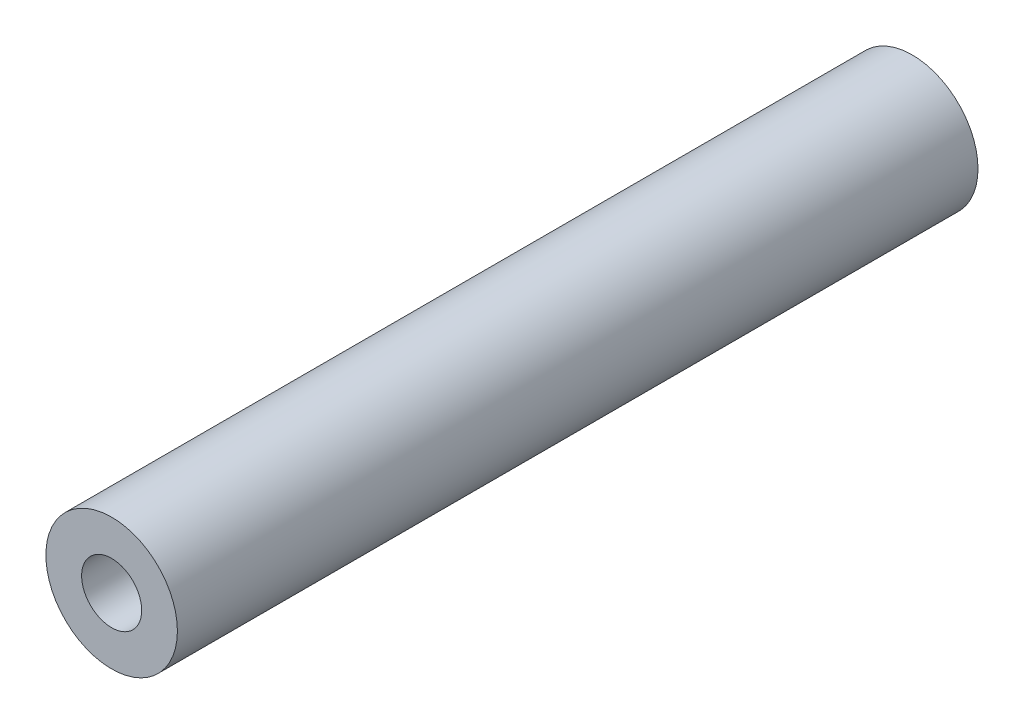
ISO-10303-21;
HEADER;
FILE_DESCRIPTION(('STEP AP214'),'2;1');
FILE_NAME('part.step','',(''),(''),'','','');
FILE_SCHEMA(('AUTOMOTIVE_DESIGN { 1 0 10303 214 1 1 1 1 }'));
ENDSEC;
DATA;
#1=APPLICATION_CONTEXT('core data for automotive mechanical design processes');
#2=APPLICATION_PROTOCOL_DEFINITION('international standard','automotive_design',2000,#1);
#3=PRODUCT_CONTEXT('',#1,'mechanical');
#4=PRODUCT('Part','Part','',(#3));
#5=PRODUCT_RELATED_PRODUCT_CATEGORY('part','',(#4));
#6=PRODUCT_DEFINITION_FORMATION('','',#4);
#7=PRODUCT_DEFINITION_CONTEXT('part definition',#1,'design');
#8=PRODUCT_DEFINITION('design','',#6,#7);
#9=PRODUCT_DEFINITION_SHAPE('','',#8);
#10=(LENGTH_UNIT() NAMED_UNIT(*) SI_UNIT(.MILLI.,.METRE.));
#11=(NAMED_UNIT(*) PLANE_ANGLE_UNIT() SI_UNIT($,.RADIAN.));
#12=(NAMED_UNIT(*) SI_UNIT($,.STERADIAN.) SOLID_ANGLE_UNIT());
#13=UNCERTAINTY_MEASURE_WITH_UNIT(LENGTH_MEASURE(1.E-05),#10,'distance_accuracy_value','');
#14=(GEOMETRIC_REPRESENTATION_CONTEXT(3) GLOBAL_UNCERTAINTY_ASSIGNED_CONTEXT((#13)) GLOBAL_UNIT_ASSIGNED_CONTEXT((#10,
#11,#12)) REPRESENTATION_CONTEXT('',''));
#15=CARTESIAN_POINT('',(0.,0.,0.));
#16=DIRECTION('',(0.,0.,1.));
#17=DIRECTION('',(1.,0.,0.));
#18=AXIS2_PLACEMENT_3D('',#15,#16,#17);
#19=CARTESIAN_POINT('',(0.,0.,28.));
#20=DIRECTION('',(0.,0.,1.));
#21=DIRECTION('',(1.,0.,0.));
#22=AXIS2_PLACEMENT_3D('',#19,#20,#21);
#23=PLANE('',#22);
#24=CARTESIAN_POINT('',(0.,0.,28.));
#25=DIRECTION('',(0.,0.,1.));
#26=DIRECTION('',(1.,0.,0.));
#27=AXIS2_PLACEMENT_3D('',#24,#25,#26);
#28=CIRCLE('',#27,2.3);
#29=CARTESIAN_POINT('',(2.3,0.,28.));
#30=VERTEX_POINT('',#29);
#31=EDGE_CURVE('E10',#30,#30,#28,.T.);
#32=ORIENTED_EDGE('',*,*,#31,.T.);
#33=EDGE_LOOP('',(#32));
#34=FACE_BOUND('',#33,.T.);
#35=CARTESIAN_POINT('',(0.,0.,28.));
#36=DIRECTION('',(0.,0.,1.));
#37=DIRECTION('',(1.,0.,0.));
#38=AXIS2_PLACEMENT_3D('',#35,#36,#37);
#39=CIRCLE('',#38,1.05);
#40=CARTESIAN_POINT('',(1.05,0.,28.));
#41=VERTEX_POINT('',#40);
#42=EDGE_CURVE('E56',#41,#41,#39,.T.);
#43=ORIENTED_EDGE('',*,*,#42,.F.);
#44=EDGE_LOOP('',(#43));
#45=FACE_BOUND('',#44,.T.);
#46=ADVANCED_FACE('F43',(#34,#45),#23,.T.);
#47=CARTESIAN_POINT('',(0.,0.,0.));
#48=DIRECTION('',(0.,0.,1.));
#49=DIRECTION('',(1.,0.,0.));
#50=AXIS2_PLACEMENT_3D('',#47,#48,#49);
#51=PLANE('',#50);
#52=CARTESIAN_POINT('',(0.,0.,0.));
#53=DIRECTION('',(0.,0.,1.));
#54=DIRECTION('',(1.,0.,0.));
#55=AXIS2_PLACEMENT_3D('',#52,#53,#54);
#56=CIRCLE('',#55,2.3);
#57=CARTESIAN_POINT('',(2.3,0.,0.));
#58=VERTEX_POINT('',#57);
#59=EDGE_CURVE('E47',#58,#58,#56,.T.);
#60=ORIENTED_EDGE('',*,*,#59,.F.);
#61=EDGE_LOOP('',(#60));
#62=FACE_BOUND('',#61,.T.);
#63=CARTESIAN_POINT('',(0.,0.,0.));
#64=DIRECTION('',(0.,0.,1.));
#65=DIRECTION('',(1.,0.,0.));
#66=AXIS2_PLACEMENT_3D('',#63,#64,#65);
#67=CIRCLE('',#66,1.05);
#68=CARTESIAN_POINT('',(1.05,0.,0.));
#69=VERTEX_POINT('',#68);
#70=EDGE_CURVE('E58',#69,#69,#67,.T.);
#71=ORIENTED_EDGE('',*,*,#70,.T.);
#72=EDGE_LOOP('',(#71));
#73=FACE_BOUND('',#72,.T.);
#74=ADVANCED_FACE('F70',(#62,#73),#51,.F.);
#75=CARTESIAN_POINT('',(0.,0.,28.));
#76=DIRECTION('',(0.,0.,-1.));
#77=DIRECTION('',(-1.,0.,0.));
#78=AXIS2_PLACEMENT_3D('',#75,#76,#77);
#79=CYLINDRICAL_SURFACE('',#78,2.3);
#80=ORIENTED_EDGE('',*,*,#31,.F.);
#81=EDGE_LOOP('',(#80));
#82=FACE_BOUND('',#81,.T.);
#83=ORIENTED_EDGE('',*,*,#59,.T.);
#84=EDGE_LOOP('',(#83));
#85=FACE_BOUND('',#84,.T.);
#86=ADVANCED_FACE('F45',(#82,#85),#79,.T.);
#87=CARTESIAN_POINT('',(0.,0.,28.));
#88=DIRECTION('',(0.,0.,-1.));
#89=DIRECTION('',(-1.,0.,0.));
#90=AXIS2_PLACEMENT_3D('',#87,#88,#89);
#91=CYLINDRICAL_SURFACE('',#90,1.05);
#92=ORIENTED_EDGE('',*,*,#42,.T.);
#93=EDGE_LOOP('',(#92));
#94=FACE_BOUND('',#93,.T.);
#95=ORIENTED_EDGE('',*,*,#70,.F.);
#96=EDGE_LOOP('',(#95));
#97=FACE_BOUND('',#96,.T.);
#98=ADVANCED_FACE('F66',(#94,#97),#91,.F.);
#99=CLOSED_SHELL('',(#46,#74,#86,#98));
#100=MANIFOLD_SOLID_BREP('B2',#99);
#101=ADVANCED_BREP_SHAPE_REPRESENTATION('',(#18,#100),#14);
#102=SHAPE_DEFINITION_REPRESENTATION(#9,#101);
ENDSEC;
END-ISO-10303-21;
